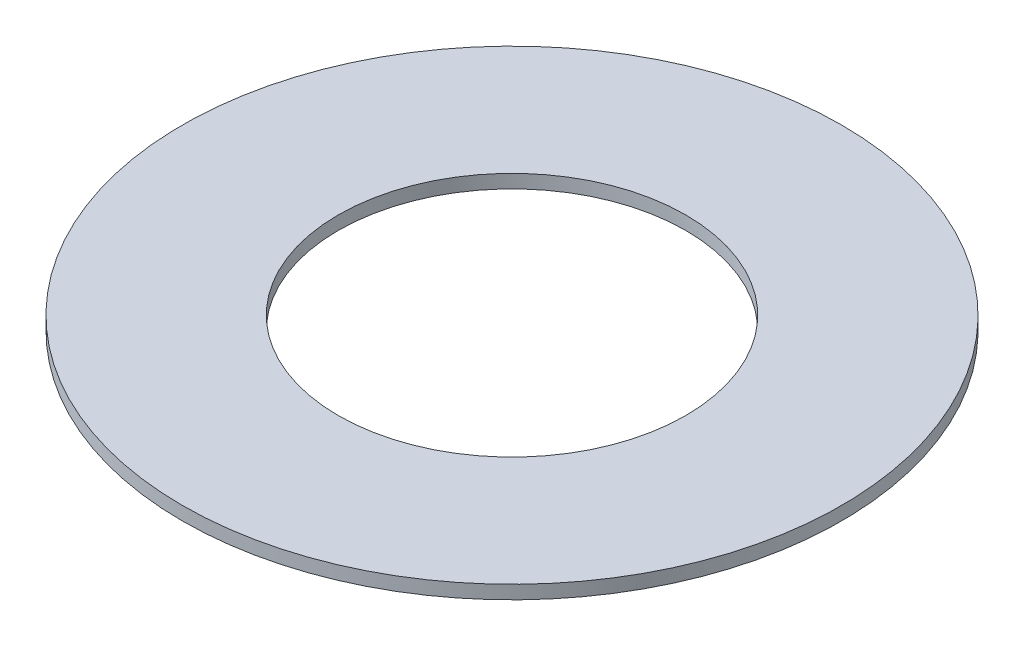
ISO-10303-21;
HEADER;
FILE_DESCRIPTION(('STEP AP214'),'2;1');
FILE_NAME('part.step','',(''),(''),'','','');
FILE_SCHEMA(('AUTOMOTIVE_DESIGN { 1 0 10303 214 1 1 1 1 }'));
ENDSEC;
DATA;
#1=APPLICATION_CONTEXT('core data for automotive mechanical design processes');
#2=APPLICATION_PROTOCOL_DEFINITION('international standard','automotive_design',2000,#1);
#3=PRODUCT_CONTEXT('',#1,'mechanical');
#4=PRODUCT('Part','Part','',(#3));
#5=PRODUCT_RELATED_PRODUCT_CATEGORY('part','',(#4));
#6=PRODUCT_DEFINITION_FORMATION('','',#4);
#7=PRODUCT_DEFINITION_CONTEXT('part definition',#1,'design');
#8=PRODUCT_DEFINITION('design','',#6,#7);
#9=PRODUCT_DEFINITION_SHAPE('','',#8);
#10=(LENGTH_UNIT() NAMED_UNIT(*) SI_UNIT(.MILLI.,.METRE.));
#11=(NAMED_UNIT(*) PLANE_ANGLE_UNIT() SI_UNIT($,.RADIAN.));
#12=(NAMED_UNIT(*) SI_UNIT($,.STERADIAN.) SOLID_ANGLE_UNIT());
#13=UNCERTAINTY_MEASURE_WITH_UNIT(LENGTH_MEASURE(1.E-05),#10,'distance_accuracy_value','');
#14=(GEOMETRIC_REPRESENTATION_CONTEXT(3) GLOBAL_UNCERTAINTY_ASSIGNED_CONTEXT((#13)) GLOBAL_UNIT_ASSIGNED_CONTEXT((#10,
#11,#12)) REPRESENTATION_CONTEXT('',''));
#15=CARTESIAN_POINT('',(0.,0.,0.));
#16=DIRECTION('',(0.,0.,1.));
#17=DIRECTION('',(1.,0.,0.));
#18=AXIS2_PLACEMENT_3D('',#15,#16,#17);
#19=CARTESIAN_POINT('',(0.,0.9,0.));
#20=DIRECTION('',(0.,1.,0.));
#21=DIRECTION('',(0.,0.,1.));
#22=AXIS2_PLACEMENT_3D('',#19,#20,#21);
#23=PLANE('',#22);
#24=CARTESIAN_POINT('',(0.,0.9,0.));
#25=DIRECTION('',(0.,1.,0.));
#26=DIRECTION('',(0.,0.,1.));
#27=AXIS2_PLACEMENT_3D('',#24,#25,#26);
#28=CIRCLE('',#27,22.);
#29=CARTESIAN_POINT('',(0.,0.9,22.));
#30=VERTEX_POINT('',#29);
#31=EDGE_CURVE('E10',#30,#30,#28,.T.);
#32=ORIENTED_EDGE('',*,*,#31,.T.);
#33=EDGE_LOOP('',(#32));
#34=FACE_BOUND('',#33,.T.);
#35=CARTESIAN_POINT('',(0.,0.9,0.));
#36=DIRECTION('',(0.,1.,0.));
#37=DIRECTION('',(0.,0.,1.));
#38=AXIS2_PLACEMENT_3D('',#35,#36,#37);
#39=CIRCLE('',#38,11.6);
#40=CARTESIAN_POINT('',(0.,0.9,11.6));
#41=VERTEX_POINT('',#40);
#42=EDGE_CURVE('E46',#41,#41,#39,.T.);
#43=ORIENTED_EDGE('',*,*,#42,.F.);
#44=EDGE_LOOP('',(#43));
#45=FACE_BOUND('',#44,.T.);
#46=ADVANCED_FACE('F35',(#34,#45),#23,.T.);
#47=CARTESIAN_POINT('',(0.,0.,0.));
#48=DIRECTION('',(0.,1.,0.));
#49=DIRECTION('',(0.,0.,1.));
#50=AXIS2_PLACEMENT_3D('',#47,#48,#49);
#51=PLANE('',#50);
#52=CARTESIAN_POINT('',(0.,0.,0.));
#53=DIRECTION('',(0.,1.,0.));
#54=DIRECTION('',(0.,0.,1.));
#55=AXIS2_PLACEMENT_3D('',#52,#53,#54);
#56=CIRCLE('',#55,22.);
#57=CARTESIAN_POINT('',(0.,0.,22.));
#58=VERTEX_POINT('',#57);
#59=EDGE_CURVE('E39',#58,#58,#56,.T.);
#60=ORIENTED_EDGE('',*,*,#59,.F.);
#61=EDGE_LOOP('',(#60));
#62=FACE_BOUND('',#61,.T.);
#63=CARTESIAN_POINT('',(0.,0.,0.));
#64=DIRECTION('',(0.,1.,0.));
#65=DIRECTION('',(0.,0.,1.));
#66=AXIS2_PLACEMENT_3D('',#63,#64,#65);
#67=CIRCLE('',#66,11.6);
#68=CARTESIAN_POINT('',(0.,0.,11.6));
#69=VERTEX_POINT('',#68);
#70=EDGE_CURVE('E48',#69,#69,#67,.T.);
#71=ORIENTED_EDGE('',*,*,#70,.T.);
#72=EDGE_LOOP('',(#71));
#73=FACE_BOUND('',#72,.T.);
#74=ADVANCED_FACE('F58',(#62,#73),#51,.F.);
#75=CARTESIAN_POINT('',(0.,0.9,0.));
#76=DIRECTION('',(0.,-1.,0.));
#77=DIRECTION('',(0.,0.,-1.));
#78=AXIS2_PLACEMENT_3D('',#75,#76,#77);
#79=CYLINDRICAL_SURFACE('',#78,22.);
#80=ORIENTED_EDGE('',*,*,#31,.F.);
#81=EDGE_LOOP('',(#80));
#82=FACE_BOUND('',#81,.T.);
#83=ORIENTED_EDGE('',*,*,#59,.T.);
#84=EDGE_LOOP('',(#83));
#85=FACE_BOUND('',#84,.T.);
#86=ADVANCED_FACE('F37',(#82,#85),#79,.T.);
#87=CARTESIAN_POINT('',(0.,0.9,0.));
#88=DIRECTION('',(0.,-1.,0.));
#89=DIRECTION('',(0.,0.,-1.));
#90=AXIS2_PLACEMENT_3D('',#87,#88,#89);
#91=CYLINDRICAL_SURFACE('',#90,11.6);
#92=ORIENTED_EDGE('',*,*,#42,.T.);
#93=EDGE_LOOP('',(#92));
#94=FACE_BOUND('',#93,.T.);
#95=ORIENTED_EDGE('',*,*,#70,.F.);
#96=EDGE_LOOP('',(#95));
#97=FACE_BOUND('',#96,.T.);
#98=ADVANCED_FACE('F54',(#94,#97),#91,.F.);
#99=CLOSED_SHELL('',(#46,#74,#86,#98));
#100=MANIFOLD_SOLID_BREP('B2',#99);
#101=ADVANCED_BREP_SHAPE_REPRESENTATION('',(#18,#100),#14);
#102=SHAPE_DEFINITION_REPRESENTATION(#9,#101);
ENDSEC;
END-ISO-10303-21;
